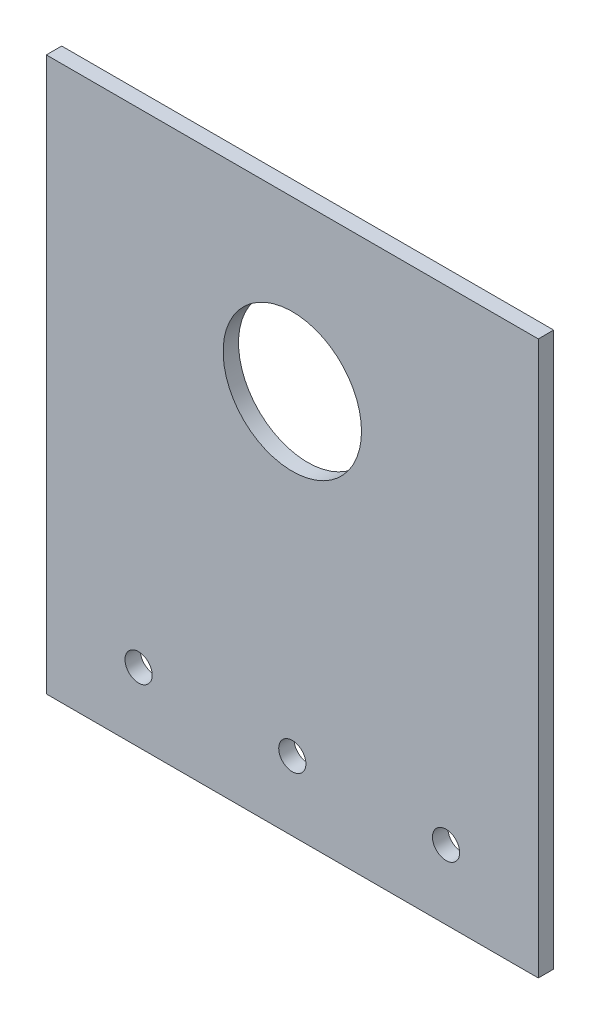
ISO-10303-21;
HEADER;
FILE_DESCRIPTION(('STEP AP214'),'2;1');
FILE_NAME('part.step','',(''),(''),'','','');
FILE_SCHEMA(('AUTOMOTIVE_DESIGN { 1 0 10303 214 1 1 1 1 }'));
ENDSEC;
DATA;
#1=APPLICATION_CONTEXT('core data for automotive mechanical design processes');
#2=APPLICATION_PROTOCOL_DEFINITION('international standard','automotive_design',2000,#1);
#3=PRODUCT_CONTEXT('',#1,'mechanical');
#4=PRODUCT('Part','Part','',(#3));
#5=PRODUCT_RELATED_PRODUCT_CATEGORY('part','',(#4));
#6=PRODUCT_DEFINITION_FORMATION('','',#4);
#7=PRODUCT_DEFINITION_CONTEXT('part definition',#1,'design');
#8=PRODUCT_DEFINITION('design','',#6,#7);
#9=PRODUCT_DEFINITION_SHAPE('','',#8);
#10=(LENGTH_UNIT() NAMED_UNIT(*) SI_UNIT(.MILLI.,.METRE.));
#11=(NAMED_UNIT(*) PLANE_ANGLE_UNIT() SI_UNIT($,.RADIAN.));
#12=(NAMED_UNIT(*) SI_UNIT($,.STERADIAN.) SOLID_ANGLE_UNIT());
#13=UNCERTAINTY_MEASURE_WITH_UNIT(LENGTH_MEASURE(1.E-05),#10,'distance_accuracy_value','');
#14=(GEOMETRIC_REPRESENTATION_CONTEXT(3) GLOBAL_UNCERTAINTY_ASSIGNED_CONTEXT((#13)) GLOBAL_UNIT_ASSIGNED_CONTEXT((#10,
#11,#12)) REPRESENTATION_CONTEXT('',''));
#15=CARTESIAN_POINT('',(0.,0.,0.));
#16=DIRECTION('',(0.,0.,1.));
#17=DIRECTION('',(1.,0.,0.));
#18=AXIS2_PLACEMENT_3D('',#15,#16,#17);
#19=CARTESIAN_POINT('',(50.7999999999999,57.15,3.175));
#20=DIRECTION('',(-1.,0.,0.));
#21=DIRECTION('',(0.,-1.,0.));
#22=AXIS2_PLACEMENT_3D('',#19,#20,#21);
#23=PLANE('',#22);
#24=DIRECTION('',(0.,1.,0.));
#25=VECTOR('',#24,1.);
#26=CARTESIAN_POINT('',(50.7999999999999,57.15,0.));
#27=LINE('',#26,#25);
#28=CARTESIAN_POINT('',(50.7999999999999,-57.15,0.));
#29=VERTEX_POINT('',#28);
#30=CARTESIAN_POINT('',(50.7999999999999,57.15,0.));
#31=VERTEX_POINT('',#30);
#32=EDGE_CURVE('E95',#29,#31,#27,.T.);
#33=ORIENTED_EDGE('',*,*,#32,.T.);
#34=DIRECTION('',(0.,0.,-1.));
#35=VECTOR('',#34,1.);
#36=CARTESIAN_POINT('',(50.7999999999999,57.15,3.175));
#37=LINE('',#36,#35);
#38=CARTESIAN_POINT('',(50.7999999999999,57.15,3.175));
#39=VERTEX_POINT('',#38);
#40=EDGE_CURVE('E11',#39,#31,#37,.T.);
#41=ORIENTED_EDGE('',*,*,#40,.F.);
#42=DIRECTION('',(0.,1.,0.));
#43=VECTOR('',#42,1.);
#44=CARTESIAN_POINT('',(50.7999999999999,57.15,3.175));
#45=LINE('',#44,#43);
#46=CARTESIAN_POINT('',(50.7999999999999,-57.15,3.175));
#47=VERTEX_POINT('',#46);
#48=EDGE_CURVE('E83',#47,#39,#45,.T.);
#49=ORIENTED_EDGE('',*,*,#48,.F.);
#50=DIRECTION('',(0.,0.,-1.));
#51=VECTOR('',#50,1.);
#52=CARTESIAN_POINT('',(50.7999999999999,-57.15,3.175));
#53=LINE('',#52,#51);
#54=EDGE_CURVE('E91',#47,#29,#53,.T.);
#55=ORIENTED_EDGE('',*,*,#54,.T.);
#56=EDGE_LOOP('',(#33,#41,#49,#55));
#57=FACE_BOUND('',#56,.T.);
#58=ADVANCED_FACE('F32',(#57),#23,.F.);
#59=CARTESIAN_POINT('',(-50.8000000000001,57.15,3.175));
#60=DIRECTION('',(0.,-1.,0.));
#61=DIRECTION('',(0.,0.,-1.));
#62=AXIS2_PLACEMENT_3D('',#59,#60,#61);
#63=PLANE('',#62);
#64=DIRECTION('',(-1.,0.,0.));
#65=VECTOR('',#64,1.);
#66=CARTESIAN_POINT('',(-50.8000000000001,57.15,0.));
#67=LINE('',#66,#65);
#68=CARTESIAN_POINT('',(-50.8000000000001,57.15,0.));
#69=VERTEX_POINT('',#68);
#70=EDGE_CURVE('E87',#31,#69,#67,.T.);
#71=ORIENTED_EDGE('',*,*,#70,.T.);
#72=DIRECTION('',(0.,0.,-1.));
#73=VECTOR('',#72,1.);
#74=CARTESIAN_POINT('',(-50.8000000000001,57.15,3.175));
#75=LINE('',#74,#73);
#76=CARTESIAN_POINT('',(-50.8000000000001,57.15,3.175));
#77=VERTEX_POINT('',#76);
#78=EDGE_CURVE('E40',#77,#69,#75,.T.);
#79=ORIENTED_EDGE('',*,*,#78,.F.);
#80=DIRECTION('',(-1.,0.,0.));
#81=VECTOR('',#80,1.);
#82=CARTESIAN_POINT('',(-50.8000000000001,57.15,3.175));
#83=LINE('',#82,#81);
#84=EDGE_CURVE('E78',#39,#77,#83,.T.);
#85=ORIENTED_EDGE('',*,*,#84,.F.);
#86=ORIENTED_EDGE('',*,*,#40,.T.);
#87=EDGE_LOOP('',(#71,#79,#85,#86));
#88=FACE_BOUND('',#87,.T.);
#89=ADVANCED_FACE('F86',(#88),#63,.F.);
#90=CARTESIAN_POINT('',(-50.8000000000001,57.15,3.175));
#91=DIRECTION('',(1.,0.,0.));
#92=DIRECTION('',(0.,1.,0.));
#93=AXIS2_PLACEMENT_3D('',#90,#91,#92);
#94=PLANE('',#93);
#95=DIRECTION('',(0.,-1.,0.));
#96=VECTOR('',#95,1.);
#97=CARTESIAN_POINT('',(-50.8000000000001,57.15,0.));
#98=LINE('',#97,#96);
#99=CARTESIAN_POINT('',(-50.8000000000001,-57.15,0.));
#100=VERTEX_POINT('',#99);
#101=EDGE_CURVE('E65',#69,#100,#98,.T.);
#102=ORIENTED_EDGE('',*,*,#101,.T.);
#103=DIRECTION('',(0.,0.,-1.));
#104=VECTOR('',#103,1.);
#105=CARTESIAN_POINT('',(-50.8000000000001,-57.15,3.175));
#106=LINE('',#105,#104);
#107=CARTESIAN_POINT('',(-50.8000000000001,-57.15,3.175));
#108=VERTEX_POINT('',#107);
#109=EDGE_CURVE('E88',#108,#100,#106,.T.);
#110=ORIENTED_EDGE('',*,*,#109,.F.);
#111=DIRECTION('',(0.,-1.,0.));
#112=VECTOR('',#111,1.);
#113=CARTESIAN_POINT('',(-50.8000000000001,57.15,3.175));
#114=LINE('',#113,#112);
#115=EDGE_CURVE('E81',#77,#108,#114,.T.);
#116=ORIENTED_EDGE('',*,*,#115,.F.);
#117=ORIENTED_EDGE('',*,*,#78,.T.);
#118=EDGE_LOOP('',(#102,#110,#116,#117));
#119=FACE_BOUND('',#118,.T.);
#120=ADVANCED_FACE('F89',(#119),#94,.F.);
#121=CARTESIAN_POINT('',(-50.8000000000001,-57.15,3.175));
#122=DIRECTION('',(0.,1.,0.));
#123=DIRECTION('',(0.,0.,1.));
#124=AXIS2_PLACEMENT_3D('',#121,#122,#123);
#125=PLANE('',#124);
#126=DIRECTION('',(1.,0.,0.));
#127=VECTOR('',#126,1.);
#128=CARTESIAN_POINT('',(-50.8000000000001,-57.15,0.));
#129=LINE('',#128,#127);
#130=EDGE_CURVE('E71',#100,#29,#129,.T.);
#131=ORIENTED_EDGE('',*,*,#130,.T.);
#132=ORIENTED_EDGE('',*,*,#54,.F.);
#133=DIRECTION('',(1.,0.,0.));
#134=VECTOR('',#133,1.);
#135=CARTESIAN_POINT('',(-50.8000000000001,-57.15,3.175));
#136=LINE('',#135,#134);
#137=EDGE_CURVE('E48',#108,#47,#136,.T.);
#138=ORIENTED_EDGE('',*,*,#137,.F.);
#139=ORIENTED_EDGE('',*,*,#109,.T.);
#140=EDGE_LOOP('',(#131,#132,#138,#139));
#141=FACE_BOUND('',#140,.T.);
#142=ADVANCED_FACE('F103',(#141),#125,.F.);
#143=CARTESIAN_POINT('',(0.,0.,3.175));
#144=DIRECTION('',(0.,0.,1.));
#145=DIRECTION('',(1.,0.,0.));
#146=AXIS2_PLACEMENT_3D('',#143,#144,#145);
#147=PLANE('',#146);
#148=CARTESIAN_POINT('',(-31.7500000000001,-42.8625,3.175));
#149=DIRECTION('',(0.,0.,1.));
#150=DIRECTION('',(1.,0.,0.));
#151=AXIS2_PLACEMENT_3D('',#148,#149,#150);
#152=CIRCLE('',#151,2.8067);
#153=CARTESIAN_POINT('',(-28.9433000000001,-42.8625,3.175));
#154=VERTEX_POINT('',#153);
#155=EDGE_CURVE('E129',#154,#154,#152,.T.);
#156=ORIENTED_EDGE('',*,*,#155,.F.);
#157=EDGE_LOOP('',(#156));
#158=FACE_BOUND('',#157,.T.);
#159=CARTESIAN_POINT('',(0.,-42.8625,3.175));
#160=DIRECTION('',(0.,0.,1.));
#161=DIRECTION('',(1.,0.,0.));
#162=AXIS2_PLACEMENT_3D('',#159,#160,#161);
#163=CIRCLE('',#162,2.8067);
#164=CARTESIAN_POINT('',(2.80669999999993,-42.8625,3.175));
#165=VERTEX_POINT('',#164);
#166=EDGE_CURVE('E123',#165,#165,#163,.T.);
#167=ORIENTED_EDGE('',*,*,#166,.F.);
#168=EDGE_LOOP('',(#167));
#169=FACE_BOUND('',#168,.T.);
#170=CARTESIAN_POINT('',(31.7499999999999,-42.8625,3.175));
#171=DIRECTION('',(0.,0.,1.));
#172=DIRECTION('',(1.,0.,0.));
#173=AXIS2_PLACEMENT_3D('',#170,#171,#172);
#174=CIRCLE('',#173,2.8067);
#175=CARTESIAN_POINT('',(34.5566999999999,-42.8625,3.175));
#176=VERTEX_POINT('',#175);
#177=EDGE_CURVE('E117',#176,#176,#174,.T.);
#178=ORIENTED_EDGE('',*,*,#177,.F.);
#179=EDGE_LOOP('',(#178));
#180=FACE_BOUND('',#179,.T.);
#181=CARTESIAN_POINT('',(0.,22.352,3.175));
#182=DIRECTION('',(0.,0.,1.));
#183=DIRECTION('',(1.,0.,0.));
#184=AXIS2_PLACEMENT_3D('',#181,#182,#183);
#185=CIRCLE('',#184,14.2875);
#186=CARTESIAN_POINT('',(14.2875,22.352,3.175));
#187=VERTEX_POINT('',#186);
#188=EDGE_CURVE('E109',#187,#187,#185,.T.);
#189=ORIENTED_EDGE('',*,*,#188,.F.);
#190=EDGE_LOOP('',(#189));
#191=FACE_BOUND('',#190,.T.);
#192=ORIENTED_EDGE('',*,*,#48,.T.);
#193=ORIENTED_EDGE('',*,*,#84,.T.);
#194=ORIENTED_EDGE('',*,*,#115,.T.);
#195=ORIENTED_EDGE('',*,*,#137,.T.);
#196=EDGE_LOOP('',(#192,#193,#194,#195));
#197=FACE_BOUND('',#196,.T.);
#198=ADVANCED_FACE('F79',(#158,#169,#180,#191,#197),#147,.T.);
#199=CARTESIAN_POINT('',(0.,0.,0.));
#200=DIRECTION('',(0.,0.,1.));
#201=DIRECTION('',(1.,0.,0.));
#202=AXIS2_PLACEMENT_3D('',#199,#200,#201);
#203=PLANE('',#202);
#204=CARTESIAN_POINT('',(-31.7500000000001,-42.8625,0.));
#205=DIRECTION('',(0.,0.,1.));
#206=DIRECTION('',(1.,0.,0.));
#207=AXIS2_PLACEMENT_3D('',#204,#205,#206);
#208=CIRCLE('',#207,2.8067);
#209=CARTESIAN_POINT('',(-28.9433000000001,-42.8625,0.));
#210=VERTEX_POINT('',#209);
#211=EDGE_CURVE('E126',#210,#210,#208,.T.);
#212=ORIENTED_EDGE('',*,*,#211,.T.);
#213=EDGE_LOOP('',(#212));
#214=FACE_BOUND('',#213,.T.);
#215=CARTESIAN_POINT('',(0.,-42.8625,0.));
#216=DIRECTION('',(0.,0.,1.));
#217=DIRECTION('',(1.,0.,0.));
#218=AXIS2_PLACEMENT_3D('',#215,#216,#217);
#219=CIRCLE('',#218,2.8067);
#220=CARTESIAN_POINT('',(2.80669999999993,-42.8625,0.));
#221=VERTEX_POINT('',#220);
#222=EDGE_CURVE('E120',#221,#221,#219,.T.);
#223=ORIENTED_EDGE('',*,*,#222,.T.);
#224=EDGE_LOOP('',(#223));
#225=FACE_BOUND('',#224,.T.);
#226=CARTESIAN_POINT('',(31.7499999999999,-42.8625,0.));
#227=DIRECTION('',(0.,0.,1.));
#228=DIRECTION('',(1.,0.,0.));
#229=AXIS2_PLACEMENT_3D('',#226,#227,#228);
#230=CIRCLE('',#229,2.8067);
#231=CARTESIAN_POINT('',(34.5566999999999,-42.8625,0.));
#232=VERTEX_POINT('',#231);
#233=EDGE_CURVE('E112',#232,#232,#230,.T.);
#234=ORIENTED_EDGE('',*,*,#233,.T.);
#235=EDGE_LOOP('',(#234));
#236=FACE_BOUND('',#235,.T.);
#237=CARTESIAN_POINT('',(0.,22.352,0.));
#238=DIRECTION('',(0.,0.,1.));
#239=DIRECTION('',(1.,0.,0.));
#240=AXIS2_PLACEMENT_3D('',#237,#238,#239);
#241=CIRCLE('',#240,14.2875);
#242=CARTESIAN_POINT('',(14.2875,22.352,0.));
#243=VERTEX_POINT('',#242);
#244=EDGE_CURVE('E98',#243,#243,#241,.T.);
#245=ORIENTED_EDGE('',*,*,#244,.T.);
#246=EDGE_LOOP('',(#245));
#247=FACE_BOUND('',#246,.T.);
#248=ORIENTED_EDGE('',*,*,#32,.F.);
#249=ORIENTED_EDGE('',*,*,#130,.F.);
#250=ORIENTED_EDGE('',*,*,#101,.F.);
#251=ORIENTED_EDGE('',*,*,#70,.F.);
#252=EDGE_LOOP('',(#248,#249,#250,#251));
#253=FACE_BOUND('',#252,.T.);
#254=ADVANCED_FACE('F106',(#214,#225,#236,#247,#253),#203,.F.);
#255=CARTESIAN_POINT('',(0.,22.352,0.));
#256=DIRECTION('',(0.,0.,1.));
#257=DIRECTION('',(1.,0.,0.));
#258=AXIS2_PLACEMENT_3D('',#255,#256,#257);
#259=CYLINDRICAL_SURFACE('',#258,14.2875);
#260=ORIENTED_EDGE('',*,*,#244,.F.);
#261=EDGE_LOOP('',(#260));
#262=FACE_BOUND('',#261,.T.);
#263=ORIENTED_EDGE('',*,*,#188,.T.);
#264=EDGE_LOOP('',(#263));
#265=FACE_BOUND('',#264,.T.);
#266=ADVANCED_FACE('F144',(#262,#265),#259,.F.);
#267=CARTESIAN_POINT('',(31.7499999999999,-42.8625,3.175));
#268=DIRECTION('',(0.,0.,1.));
#269=DIRECTION('',(1.,0.,0.));
#270=AXIS2_PLACEMENT_3D('',#267,#268,#269);
#271=CYLINDRICAL_SURFACE('',#270,2.8067);
#272=ORIENTED_EDGE('',*,*,#233,.F.);
#273=EDGE_LOOP('',(#272));
#274=FACE_BOUND('',#273,.T.);
#275=ORIENTED_EDGE('',*,*,#177,.T.);
#276=EDGE_LOOP('',(#275));
#277=FACE_BOUND('',#276,.T.);
#278=ADVANCED_FACE('F146',(#274,#277),#271,.F.);
#279=CARTESIAN_POINT('',(0.,-42.8625,3.175));
#280=DIRECTION('',(0.,0.,1.));
#281=DIRECTION('',(1.,0.,0.));
#282=AXIS2_PLACEMENT_3D('',#279,#280,#281);
#283=CYLINDRICAL_SURFACE('',#282,2.8067);
#284=ORIENTED_EDGE('',*,*,#222,.F.);
#285=EDGE_LOOP('',(#284));
#286=FACE_BOUND('',#285,.T.);
#287=ORIENTED_EDGE('',*,*,#166,.T.);
#288=EDGE_LOOP('',(#287));
#289=FACE_BOUND('',#288,.T.);
#290=ADVANCED_FACE('F153',(#286,#289),#283,.F.);
#291=CARTESIAN_POINT('',(-31.7500000000001,-42.8625,3.175));
#292=DIRECTION('',(0.,0.,1.));
#293=DIRECTION('',(1.,0.,0.));
#294=AXIS2_PLACEMENT_3D('',#291,#292,#293);
#295=CYLINDRICAL_SURFACE('',#294,2.8067);
#296=ORIENTED_EDGE('',*,*,#211,.F.);
#297=EDGE_LOOP('',(#296));
#298=FACE_BOUND('',#297,.T.);
#299=ORIENTED_EDGE('',*,*,#155,.T.);
#300=EDGE_LOOP('',(#299));
#301=FACE_BOUND('',#300,.T.);
#302=ADVANCED_FACE('F133',(#298,#301),#295,.F.);
#303=CLOSED_SHELL('',(#58,#89,#120,#142,#198,#254,#266,#278,#290,#302));
#304=MANIFOLD_SOLID_BREP('B2',#303);
#305=ADVANCED_BREP_SHAPE_REPRESENTATION('',(#18,#304),#14);
#306=SHAPE_DEFINITION_REPRESENTATION(#9,#305);
ENDSEC;
END-ISO-10303-21;
